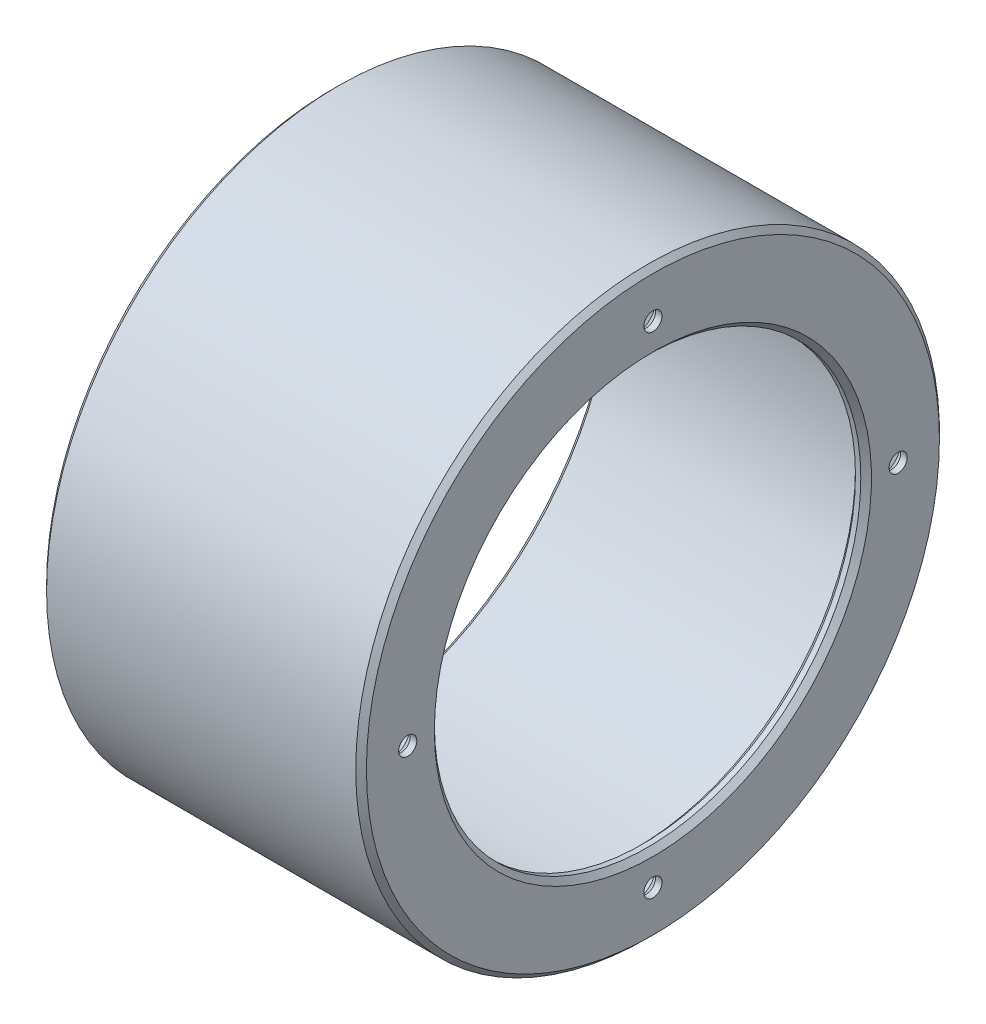
ISO-10303-21;
HEADER;
FILE_DESCRIPTION(('STEP AP214'),'2;1');
FILE_NAME('part.step','',(''),(''),'','','');
FILE_SCHEMA(('AUTOMOTIVE_DESIGN { 1 0 10303 214 1 1 1 1 }'));
ENDSEC;
DATA;
#1=APPLICATION_CONTEXT('core data for automotive mechanical design processes');
#2=APPLICATION_PROTOCOL_DEFINITION('international standard','automotive_design',2000,#1);
#3=PRODUCT_CONTEXT('',#1,'mechanical');
#4=PRODUCT('Part','Part','',(#3));
#5=PRODUCT_RELATED_PRODUCT_CATEGORY('part','',(#4));
#6=PRODUCT_DEFINITION_FORMATION('','',#4);
#7=PRODUCT_DEFINITION_CONTEXT('part definition',#1,'design');
#8=PRODUCT_DEFINITION('design','',#6,#7);
#9=PRODUCT_DEFINITION_SHAPE('','',#8);
#10=(LENGTH_UNIT() NAMED_UNIT(*) SI_UNIT(.MILLI.,.METRE.));
#11=(NAMED_UNIT(*) PLANE_ANGLE_UNIT() SI_UNIT($,.RADIAN.));
#12=(NAMED_UNIT(*) SI_UNIT($,.STERADIAN.) SOLID_ANGLE_UNIT());
#13=UNCERTAINTY_MEASURE_WITH_UNIT(LENGTH_MEASURE(1.E-05),#10,'distance_accuracy_value','');
#14=(GEOMETRIC_REPRESENTATION_CONTEXT(3) GLOBAL_UNCERTAINTY_ASSIGNED_CONTEXT((#13)) GLOBAL_UNIT_ASSIGNED_CONTEXT((#10,
#11,#12)) REPRESENTATION_CONTEXT('',''));
#15=CARTESIAN_POINT('',(0.,0.,0.));
#16=DIRECTION('',(0.,0.,1.));
#17=DIRECTION('',(1.,0.,0.));
#18=AXIS2_PLACEMENT_3D('',#15,#16,#17);
#19=CARTESIAN_POINT('',(0.,51.5,0.));
#20=DIRECTION('',(1.,0.,0.));
#21=DIRECTION('',(0.,0.,-1.));
#22=AXIS2_PLACEMENT_3D('',#19,#20,#21);
#23=PLANE('',#22);
#24=CARTESIAN_POINT('',(0.,0.,0.));
#25=DIRECTION('',(1.,0.,0.));
#26=DIRECTION('',(0.,0.,-1.));
#27=AXIS2_PLACEMENT_3D('',#24,#25,#26);
#28=CIRCLE('',#27,53.75);
#29=CARTESIAN_POINT('',(0.,0.,-53.75));
#30=VERTEX_POINT('',#29);
#31=EDGE_CURVE('E129',#30,#30,#28,.F.);
#32=ORIENTED_EDGE('',*,*,#31,.T.);
#33=EDGE_LOOP('',(#32));
#34=FACE_BOUND('',#33,.T.);
#35=CARTESIAN_POINT('',(0.,0.,0.));
#36=DIRECTION('',(1.,0.,0.));
#37=DIRECTION('',(0.,0.,-1.));
#38=AXIS2_PLACEMENT_3D('',#35,#36,#37);
#39=CIRCLE('',#38,52.5);
#40=CARTESIAN_POINT('',(0.,0.,-52.5));
#41=VERTEX_POINT('',#40);
#42=EDGE_CURVE('E125',#41,#41,#39,.T.);
#43=ORIENTED_EDGE('',*,*,#42,.T.);
#44=EDGE_LOOP('',(#43));
#45=FACE_BOUND('',#44,.T.);
#46=ADVANCED_FACE('F45',(#34,#45),#23,.F.);
#47=CARTESIAN_POINT('',(0.,0.,0.));
#48=DIRECTION('',(-1.,0.,0.));
#49=DIRECTION('',(0.,0.,1.));
#50=AXIS2_PLACEMENT_3D('',#47,#48,#49);
#51=CYLINDRICAL_SURFACE('',#50,54.75);
#52=CARTESIAN_POINT('',(59.,0.,0.));
#53=DIRECTION('',(-1.,0.,0.));
#54=DIRECTION('',(0.,0.,1.));
#55=AXIS2_PLACEMENT_3D('',#52,#53,#54);
#56=CIRCLE('',#55,54.75);
#57=CARTESIAN_POINT('',(59.,0.,54.75));
#58=VERTEX_POINT('',#57);
#59=EDGE_CURVE('E113',#58,#58,#56,.T.);
#60=ORIENTED_EDGE('',*,*,#59,.T.);
#61=EDGE_LOOP('',(#60));
#62=FACE_BOUND('',#61,.T.);
#63=CARTESIAN_POINT('',(1.,0.,0.));
#64=DIRECTION('',(1.,0.,0.));
#65=DIRECTION('',(0.,0.,-1.));
#66=AXIS2_PLACEMENT_3D('',#63,#64,#65);
#67=CIRCLE('',#66,54.75);
#68=CARTESIAN_POINT('',(1.,0.,-54.75));
#69=VERTEX_POINT('',#68);
#70=EDGE_CURVE('E109',#69,#69,#67,.T.);
#71=ORIENTED_EDGE('',*,*,#70,.T.);
#72=EDGE_LOOP('',(#71));
#73=FACE_BOUND('',#72,.T.);
#74=ADVANCED_FACE('F153',(#62,#73),#51,.T.);
#75=CARTESIAN_POINT('',(60.,54.75,0.));
#76=DIRECTION('',(-1.,0.,0.));
#77=DIRECTION('',(0.,0.,1.));
#78=AXIS2_PLACEMENT_3D('',#75,#76,#77);
#79=PLANE('',#78);
#80=CARTESIAN_POINT('',(60.,4.81824424760352E-13,46.));
#81=DIRECTION('',(-1.,0.,0.));
#82=DIRECTION('',(0.,0.,1.));
#83=AXIS2_PLACEMENT_3D('',#80,#81,#82);
#84=CIRCLE('',#83,1.7);
#85=CARTESIAN_POINT('',(60.,4.81824424760352E-13,47.7));
#86=VERTEX_POINT('',#85);
#87=EDGE_CURVE('E50',#86,#86,#84,.T.);
#88=ORIENTED_EDGE('',*,*,#87,.T.);
#89=EDGE_LOOP('',(#88));
#90=FACE_BOUND('',#89,.T.);
#91=CARTESIAN_POINT('',(60.,-46.,0.));
#92=DIRECTION('',(-1.,0.,0.));
#93=DIRECTION('',(0.,0.,1.));
#94=AXIS2_PLACEMENT_3D('',#91,#92,#93);
#95=CIRCLE('',#94,1.7);
#96=CARTESIAN_POINT('',(60.,-46.,1.7));
#97=VERTEX_POINT('',#96);
#98=EDGE_CURVE('E76',#97,#97,#95,.T.);
#99=ORIENTED_EDGE('',*,*,#98,.T.);
#100=EDGE_LOOP('',(#99));
#101=FACE_BOUND('',#100,.T.);
#102=CARTESIAN_POINT('',(60.,-1.60608141586784E-13,-46.));
#103=DIRECTION('',(-1.,0.,0.));
#104=DIRECTION('',(0.,0.,1.));
#105=AXIS2_PLACEMENT_3D('',#102,#103,#104);
#106=CIRCLE('',#105,1.7);
#107=CARTESIAN_POINT('',(60.,-1.60608141586784E-13,-44.3));
#108=VERTEX_POINT('',#107);
#109=EDGE_CURVE('E71',#108,#108,#106,.T.);
#110=ORIENTED_EDGE('',*,*,#109,.T.);
#111=EDGE_LOOP('',(#110));
#112=FACE_BOUND('',#111,.T.);
#113=CARTESIAN_POINT('',(60.,46.,0.));
#114=DIRECTION('',(-1.,0.,0.));
#115=DIRECTION('',(0.,0.,1.));
#116=AXIS2_PLACEMENT_3D('',#113,#114,#115);
#117=CIRCLE('',#116,1.7);
#118=CARTESIAN_POINT('',(60.,46.,1.7));
#119=VERTEX_POINT('',#118);
#120=EDGE_CURVE('E65',#119,#119,#117,.T.);
#121=ORIENTED_EDGE('',*,*,#120,.T.);
#122=EDGE_LOOP('',(#121));
#123=FACE_BOUND('',#122,.T.);
#124=CARTESIAN_POINT('',(60.,0.,0.));
#125=DIRECTION('',(-1.,0.,0.));
#126=DIRECTION('',(0.,0.,1.));
#127=AXIS2_PLACEMENT_3D('',#124,#125,#126);
#128=CIRCLE('',#127,53.75);
#129=CARTESIAN_POINT('',(60.,0.,53.75));
#130=VERTEX_POINT('',#129);
#131=EDGE_CURVE('E121',#130,#130,#128,.F.);
#132=ORIENTED_EDGE('',*,*,#131,.T.);
#133=EDGE_LOOP('',(#132));
#134=FACE_BOUND('',#133,.T.);
#135=CARTESIAN_POINT('',(60.,0.,0.));
#136=DIRECTION('',(-1.,0.,0.));
#137=DIRECTION('',(0.,0.,1.));
#138=AXIS2_PLACEMENT_3D('',#135,#136,#137);
#139=CIRCLE('',#138,41.);
#140=CARTESIAN_POINT('',(60.,0.,41.));
#141=VERTEX_POINT('',#140);
#142=EDGE_CURVE('E117',#141,#141,#139,.T.);
#143=ORIENTED_EDGE('',*,*,#142,.T.);
#144=EDGE_LOOP('',(#143));
#145=FACE_BOUND('',#144,.T.);
#146=ADVANCED_FACE('F151',(#90,#101,#112,#123,#134,#145),#79,.F.);
#147=CARTESIAN_POINT('',(0.,0.,0.));
#148=DIRECTION('',(-1.,0.,0.));
#149=DIRECTION('',(0.,0.,1.));
#150=AXIS2_PLACEMENT_3D('',#147,#148,#149);
#151=CYLINDRICAL_SURFACE('',#150,40.);
#152=CARTESIAN_POINT('',(59.,0.,0.));
#153=DIRECTION('',(-1.,0.,0.));
#154=DIRECTION('',(0.,0.,1.));
#155=AXIS2_PLACEMENT_3D('',#152,#153,#154);
#156=CIRCLE('',#155,40.);
#157=CARTESIAN_POINT('',(59.,0.,40.));
#158=VERTEX_POINT('',#157);
#159=EDGE_CURVE('E61',#158,#158,#156,.F.);
#160=ORIENTED_EDGE('',*,*,#159,.T.);
#161=EDGE_LOOP('',(#160));
#162=FACE_BOUND('',#161,.T.);
#163=CARTESIAN_POINT('',(58.,0.,0.));
#164=DIRECTION('',(1.,0.,0.));
#165=DIRECTION('',(0.,0.,-1.));
#166=AXIS2_PLACEMENT_3D('',#163,#164,#165);
#167=CIRCLE('',#166,40.);
#168=CARTESIAN_POINT('',(58.,0.,-40.));
#169=VERTEX_POINT('',#168);
#170=EDGE_CURVE('E133',#169,#169,#167,.F.);
#171=ORIENTED_EDGE('',*,*,#170,.T.);
#172=EDGE_LOOP('',(#171));
#173=FACE_BOUND('',#172,.T.);
#174=ADVANCED_FACE('F140',(#162,#173),#151,.F.);
#175=CARTESIAN_POINT('',(57.,40.,0.));
#176=DIRECTION('',(1.,0.,0.));
#177=DIRECTION('',(0.,0.,-1.));
#178=AXIS2_PLACEMENT_3D('',#175,#176,#177);
#179=PLANE('',#178);
#180=CARTESIAN_POINT('',(57.,4.81824424760352E-13,46.));
#181=DIRECTION('',(-1.,0.,0.));
#182=DIRECTION('',(0.,0.,1.));
#183=AXIS2_PLACEMENT_3D('',#180,#181,#182);
#184=CIRCLE('',#183,3.47);
#185=CARTESIAN_POINT('',(57.,4.81824424760352E-13,49.47));
#186=VERTEX_POINT('',#185);
#187=EDGE_CURVE('E250',#186,#186,#184,.T.);
#188=ORIENTED_EDGE('',*,*,#187,.F.);
#189=EDGE_LOOP('',(#188));
#190=FACE_BOUND('',#189,.T.);
#191=CARTESIAN_POINT('',(57.,-46.,0.));
#192=DIRECTION('',(-1.,0.,0.));
#193=DIRECTION('',(0.,0.,1.));
#194=AXIS2_PLACEMENT_3D('',#191,#192,#193);
#195=CIRCLE('',#194,3.47);
#196=CARTESIAN_POINT('',(57.,-46.,3.47));
#197=VERTEX_POINT('',#196);
#198=EDGE_CURVE('E88',#197,#197,#195,.T.);
#199=ORIENTED_EDGE('',*,*,#198,.F.);
#200=EDGE_LOOP('',(#199));
#201=FACE_BOUND('',#200,.T.);
#202=CARTESIAN_POINT('',(57.,-1.60608141586784E-13,-46.));
#203=DIRECTION('',(-1.,0.,0.));
#204=DIRECTION('',(0.,0.,1.));
#205=AXIS2_PLACEMENT_3D('',#202,#203,#204);
#206=CIRCLE('',#205,3.47);
#207=CARTESIAN_POINT('',(57.,-1.60608141586784E-13,-42.53));
#208=VERTEX_POINT('',#207);
#209=EDGE_CURVE('E79',#208,#208,#206,.T.);
#210=ORIENTED_EDGE('',*,*,#209,.F.);
#211=EDGE_LOOP('',(#210));
#212=FACE_BOUND('',#211,.T.);
#213=CARTESIAN_POINT('',(57.,46.,0.));
#214=DIRECTION('',(-1.,0.,0.));
#215=DIRECTION('',(0.,0.,1.));
#216=AXIS2_PLACEMENT_3D('',#213,#214,#215);
#217=CIRCLE('',#216,3.47);
#218=CARTESIAN_POINT('',(57.,46.,3.47));
#219=VERTEX_POINT('',#218);
#220=EDGE_CURVE('E74',#219,#219,#217,.T.);
#221=ORIENTED_EDGE('',*,*,#220,.F.);
#222=EDGE_LOOP('',(#221));
#223=FACE_BOUND('',#222,.T.);
#224=CARTESIAN_POINT('',(57.,0.,0.));
#225=DIRECTION('',(1.,0.,0.));
#226=DIRECTION('',(0.,0.,-1.));
#227=AXIS2_PLACEMENT_3D('',#224,#225,#226);
#228=CIRCLE('',#227,41.);
#229=CARTESIAN_POINT('',(57.,0.,-41.));
#230=VERTEX_POINT('',#229);
#231=EDGE_CURVE('E55',#230,#230,#228,.T.);
#232=ORIENTED_EDGE('',*,*,#231,.T.);
#233=EDGE_LOOP('',(#232));
#234=FACE_BOUND('',#233,.T.);
#235=CARTESIAN_POINT('',(57.,0.,0.));
#236=DIRECTION('',(-1.,0.,0.));
#237=DIRECTION('',(0.,0.,1.));
#238=AXIS2_PLACEMENT_3D('',#235,#236,#237);
#239=CIRCLE('',#238,51.5);
#240=CARTESIAN_POINT('',(57.,0.,51.5));
#241=VERTEX_POINT('',#240);
#242=EDGE_CURVE('E69',#241,#241,#239,.T.);
#243=ORIENTED_EDGE('',*,*,#242,.T.);
#244=EDGE_LOOP('',(#243));
#245=FACE_BOUND('',#244,.T.);
#246=ADVANCED_FACE('F161',(#190,#201,#212,#223,#234,#245),#179,.F.);
#247=CARTESIAN_POINT('',(0.,0.,0.));
#248=DIRECTION('',(-1.,0.,0.));
#249=DIRECTION('',(0.,0.,1.));
#250=AXIS2_PLACEMENT_3D('',#247,#248,#249);
#251=CYLINDRICAL_SURFACE('',#250,51.5);
#252=CARTESIAN_POINT('',(1.00000000000001,0.,0.));
#253=DIRECTION('',(1.,0.,0.));
#254=DIRECTION('',(0.,0.,-1.));
#255=AXIS2_PLACEMENT_3D('',#252,#253,#254);
#256=CIRCLE('',#255,51.5);
#257=CARTESIAN_POINT('',(1.00000000000001,0.,-51.5));
#258=VERTEX_POINT('',#257);
#259=EDGE_CURVE('E10',#258,#258,#256,.F.);
#260=ORIENTED_EDGE('',*,*,#259,.T.);
#261=EDGE_LOOP('',(#260));
#262=FACE_BOUND('',#261,.T.);
#263=ORIENTED_EDGE('',*,*,#242,.F.);
#264=EDGE_LOOP('',(#263));
#265=FACE_BOUND('',#264,.T.);
#266=ADVANCED_FACE('F181',(#262,#265),#251,.F.);
#267=CARTESIAN_POINT('',(59.,0.,0.));
#268=DIRECTION('',(-1.,0.,0.));
#269=DIRECTION('',(0.,0.,1.));
#270=AXIS2_PLACEMENT_3D('',#267,#268,#269);
#271=CONICAL_SURFACE('',#270,54.75,0.785398163397445);
#272=ORIENTED_EDGE('',*,*,#131,.F.);
#273=EDGE_LOOP('',(#272));
#274=FACE_BOUND('',#273,.T.);
#275=ORIENTED_EDGE('',*,*,#59,.F.);
#276=EDGE_LOOP('',(#275));
#277=FACE_BOUND('',#276,.T.);
#278=ADVANCED_FACE('F175',(#274,#277),#271,.T.);
#279=CARTESIAN_POINT('',(0.,0.,0.));
#280=DIRECTION('',(1.,0.,0.));
#281=DIRECTION('',(0.,0.,-1.));
#282=AXIS2_PLACEMENT_3D('',#279,#280,#281);
#283=CONICAL_SURFACE('',#282,53.75,0.785398163397445);
#284=ORIENTED_EDGE('',*,*,#70,.F.);
#285=EDGE_LOOP('',(#284));
#286=FACE_BOUND('',#285,.T.);
#287=ORIENTED_EDGE('',*,*,#31,.F.);
#288=EDGE_LOOP('',(#287));
#289=FACE_BOUND('',#288,.T.);
#290=ADVANCED_FACE('F147',(#286,#289),#283,.T.);
#291=CARTESIAN_POINT('',(60.,0.,0.));
#292=DIRECTION('',(1.,0.,0.));
#293=DIRECTION('',(0.,0.,-1.));
#294=AXIS2_PLACEMENT_3D('',#291,#292,#293);
#295=CONICAL_SURFACE('',#294,41.,0.785398163397441);
#296=ORIENTED_EDGE('',*,*,#159,.F.);
#297=EDGE_LOOP('',(#296));
#298=FACE_BOUND('',#297,.T.);
#299=ORIENTED_EDGE('',*,*,#142,.F.);
#300=EDGE_LOOP('',(#299));
#301=FACE_BOUND('',#300,.T.);
#302=ADVANCED_FACE('F143',(#298,#301),#295,.F.);
#303=CARTESIAN_POINT('',(58.,0.,0.));
#304=DIRECTION('',(-1.,0.,0.));
#305=DIRECTION('',(0.,0.,1.));
#306=AXIS2_PLACEMENT_3D('',#303,#304,#305);
#307=CONICAL_SURFACE('',#306,40.,0.785398163397448);
#308=ORIENTED_EDGE('',*,*,#231,.F.);
#309=EDGE_LOOP('',(#308));
#310=FACE_BOUND('',#309,.T.);
#311=ORIENTED_EDGE('',*,*,#170,.F.);
#312=EDGE_LOOP('',(#311));
#313=FACE_BOUND('',#312,.T.);
#314=ADVANCED_FACE('F146',(#310,#313),#307,.F.);
#315=CARTESIAN_POINT('',(1.00000000000001,0.,0.));
#316=DIRECTION('',(-1.,0.,0.));
#317=DIRECTION('',(0.,0.,1.));
#318=AXIS2_PLACEMENT_3D('',#315,#316,#317);
#319=CONICAL_SURFACE('',#318,51.5,0.785398163397452);
#320=ORIENTED_EDGE('',*,*,#42,.F.);
#321=EDGE_LOOP('',(#320));
#322=FACE_BOUND('',#321,.T.);
#323=ORIENTED_EDGE('',*,*,#259,.F.);
#324=EDGE_LOOP('',(#323));
#325=FACE_BOUND('',#324,.T.);
#326=ADVANCED_FACE('F48',(#322,#325),#319,.F.);
#327=CARTESIAN_POINT('',(57.,46.,0.));
#328=DIRECTION('',(-1.,0.,0.));
#329=DIRECTION('',(0.,0.,1.));
#330=AXIS2_PLACEMENT_3D('',#327,#328,#329);
#331=CYLINDRICAL_SURFACE('',#330,1.7);
#332=CARTESIAN_POINT('',(58.77,46.,0.));
#333=DIRECTION('',(-1.,0.,0.));
#334=DIRECTION('',(0.,0.,1.));
#335=AXIS2_PLACEMENT_3D('',#332,#333,#334);
#336=CIRCLE('',#335,1.7);
#337=CARTESIAN_POINT('',(58.77,46.,1.7));
#338=VERTEX_POINT('',#337);
#339=EDGE_CURVE('E70',#338,#338,#336,.T.);
#340=ORIENTED_EDGE('',*,*,#339,.T.);
#341=EDGE_LOOP('',(#340));
#342=FACE_BOUND('',#341,.T.);
#343=ORIENTED_EDGE('',*,*,#120,.F.);
#344=EDGE_LOOP('',(#343));
#345=FACE_BOUND('',#344,.T.);
#346=ADVANCED_FACE('F198',(#342,#345),#331,.F.);
#347=CARTESIAN_POINT('',(57.,46.,0.));
#348=DIRECTION('',(-1.,0.,0.));
#349=DIRECTION('',(0.,0.,1.));
#350=AXIS2_PLACEMENT_3D('',#347,#348,#349);
#351=CONICAL_SURFACE('',#350,3.47,0.785398163397448);
#352=ORIENTED_EDGE('',*,*,#339,.F.);
#353=EDGE_LOOP('',(#352));
#354=FACE_BOUND('',#353,.T.);
#355=ORIENTED_EDGE('',*,*,#220,.T.);
#356=EDGE_LOOP('',(#355));
#357=FACE_BOUND('',#356,.T.);
#358=ADVANCED_FACE('F216',(#354,#357),#351,.F.);
#359=CARTESIAN_POINT('',(57.,-1.60608141586784E-13,-46.));
#360=DIRECTION('',(-1.,0.,0.));
#361=DIRECTION('',(0.,0.,1.));
#362=AXIS2_PLACEMENT_3D('',#359,#360,#361);
#363=CYLINDRICAL_SURFACE('',#362,1.7);
#364=CARTESIAN_POINT('',(58.77,-1.60608141586784E-13,-46.));
#365=DIRECTION('',(-1.,0.,0.));
#366=DIRECTION('',(0.,0.,1.));
#367=AXIS2_PLACEMENT_3D('',#364,#365,#366);
#368=CIRCLE('',#367,1.7);
#369=CARTESIAN_POINT('',(58.77,-1.60608141586784E-13,-44.3));
#370=VERTEX_POINT('',#369);
#371=EDGE_CURVE('E75',#370,#370,#368,.T.);
#372=ORIENTED_EDGE('',*,*,#371,.T.);
#373=EDGE_LOOP('',(#372));
#374=FACE_BOUND('',#373,.T.);
#375=ORIENTED_EDGE('',*,*,#109,.F.);
#376=EDGE_LOOP('',(#375));
#377=FACE_BOUND('',#376,.T.);
#378=ADVANCED_FACE('F219',(#374,#377),#363,.F.);
#379=CARTESIAN_POINT('',(57.,-1.60608141586784E-13,-46.));
#380=DIRECTION('',(-1.,0.,0.));
#381=DIRECTION('',(0.,0.,1.));
#382=AXIS2_PLACEMENT_3D('',#379,#380,#381);
#383=CONICAL_SURFACE('',#382,3.47,0.785398163397449);
#384=ORIENTED_EDGE('',*,*,#371,.F.);
#385=EDGE_LOOP('',(#384));
#386=FACE_BOUND('',#385,.T.);
#387=ORIENTED_EDGE('',*,*,#209,.T.);
#388=EDGE_LOOP('',(#387));
#389=FACE_BOUND('',#388,.T.);
#390=ADVANCED_FACE('F223',(#386,#389),#383,.F.);
#391=CARTESIAN_POINT('',(57.,-46.,0.));
#392=DIRECTION('',(-1.,0.,0.));
#393=DIRECTION('',(0.,0.,1.));
#394=AXIS2_PLACEMENT_3D('',#391,#392,#393);
#395=CYLINDRICAL_SURFACE('',#394,1.7);
#396=CARTESIAN_POINT('',(58.77,-46.,0.));
#397=DIRECTION('',(-1.,0.,0.));
#398=DIRECTION('',(0.,0.,1.));
#399=AXIS2_PLACEMENT_3D('',#396,#397,#398);
#400=CIRCLE('',#399,1.7);
#401=CARTESIAN_POINT('',(58.77,-46.,1.7));
#402=VERTEX_POINT('',#401);
#403=EDGE_CURVE('E80',#402,#402,#400,.T.);
#404=ORIENTED_EDGE('',*,*,#403,.T.);
#405=EDGE_LOOP('',(#404));
#406=FACE_BOUND('',#405,.T.);
#407=ORIENTED_EDGE('',*,*,#98,.F.);
#408=EDGE_LOOP('',(#407));
#409=FACE_BOUND('',#408,.T.);
#410=ADVANCED_FACE('F227',(#406,#409),#395,.F.);
#411=CARTESIAN_POINT('',(57.,-46.,0.));
#412=DIRECTION('',(-1.,0.,0.));
#413=DIRECTION('',(0.,0.,1.));
#414=AXIS2_PLACEMENT_3D('',#411,#412,#413);
#415=CONICAL_SURFACE('',#414,3.47,0.785398163397448);
#416=ORIENTED_EDGE('',*,*,#403,.F.);
#417=EDGE_LOOP('',(#416));
#418=FACE_BOUND('',#417,.T.);
#419=ORIENTED_EDGE('',*,*,#198,.T.);
#420=EDGE_LOOP('',(#419));
#421=FACE_BOUND('',#420,.T.);
#422=ADVANCED_FACE('F231',(#418,#421),#415,.F.);
#423=CARTESIAN_POINT('',(57.,4.81824424760352E-13,46.));
#424=DIRECTION('',(-1.,0.,0.));
#425=DIRECTION('',(0.,0.,1.));
#426=AXIS2_PLACEMENT_3D('',#423,#424,#425);
#427=CYLINDRICAL_SURFACE('',#426,1.7);
#428=CARTESIAN_POINT('',(58.77,4.81824424760352E-13,46.));
#429=DIRECTION('',(-1.,0.,0.));
#430=DIRECTION('',(0.,0.,1.));
#431=AXIS2_PLACEMENT_3D('',#428,#429,#430);
#432=CIRCLE('',#431,1.7);
#433=CARTESIAN_POINT('',(58.77,4.81824424760352E-13,47.7));
#434=VERTEX_POINT('',#433);
#435=EDGE_CURVE('E247',#434,#434,#432,.T.);
#436=ORIENTED_EDGE('',*,*,#435,.T.);
#437=EDGE_LOOP('',(#436));
#438=FACE_BOUND('',#437,.T.);
#439=ORIENTED_EDGE('',*,*,#87,.F.);
#440=EDGE_LOOP('',(#439));
#441=FACE_BOUND('',#440,.T.);
#442=ADVANCED_FACE('F234',(#438,#441),#427,.F.);
#443=CARTESIAN_POINT('',(57.,4.81824424760352E-13,46.));
#444=DIRECTION('',(-1.,0.,0.));
#445=DIRECTION('',(0.,0.,1.));
#446=AXIS2_PLACEMENT_3D('',#443,#444,#445);
#447=CONICAL_SURFACE('',#446,3.47,0.785398163397449);
#448=ORIENTED_EDGE('',*,*,#435,.F.);
#449=EDGE_LOOP('',(#448));
#450=FACE_BOUND('',#449,.T.);
#451=ORIENTED_EDGE('',*,*,#187,.T.);
#452=EDGE_LOOP('',(#451));
#453=FACE_BOUND('',#452,.T.);
#454=ADVANCED_FACE('F238',(#450,#453),#447,.F.);
#455=CLOSED_SHELL('',(#46,#74,#146,#174,#246,#266,#278,#290,#302,#314,#326,#346,#358,#378,#390,
#410,#422,#442,#454));
#456=MANIFOLD_SOLID_BREP('B2',#455);
#457=ADVANCED_BREP_SHAPE_REPRESENTATION('',(#18,#456),#14);
#458=SHAPE_DEFINITION_REPRESENTATION(#9,#457);
ENDSEC;
END-ISO-10303-21;
